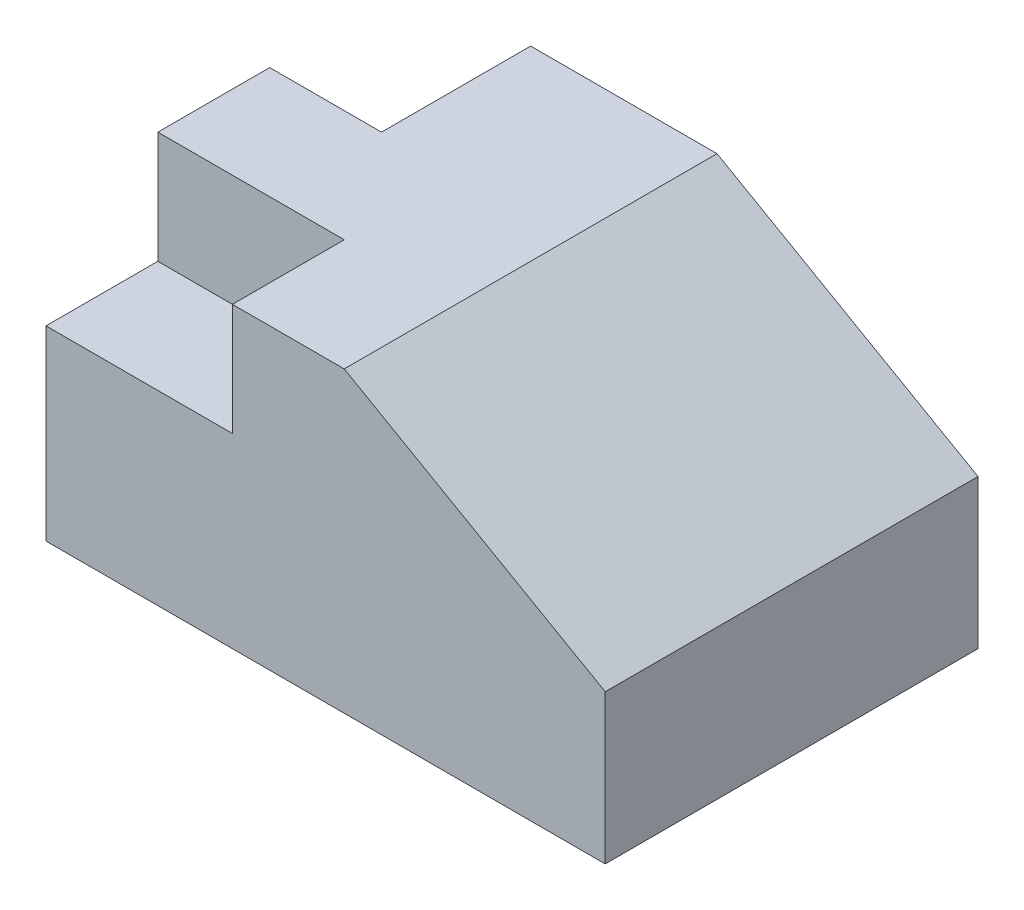
ISO-10303-21;
HEADER;
FILE_DESCRIPTION(('STEP AP214'),'2;1');
FILE_NAME('part.step','',(''),(''),'','','');
FILE_SCHEMA(('AUTOMOTIVE_DESIGN { 1 0 10303 214 1 1 1 1 }'));
ENDSEC;
DATA;
#1=APPLICATION_CONTEXT('core data for automotive mechanical design processes');
#2=APPLICATION_PROTOCOL_DEFINITION('international standard','automotive_design',2000,#1);
#3=PRODUCT_CONTEXT('',#1,'mechanical');
#4=PRODUCT('Part','Part','',(#3));
#5=PRODUCT_RELATED_PRODUCT_CATEGORY('part','',(#4));
#6=PRODUCT_DEFINITION_FORMATION('','',#4);
#7=PRODUCT_DEFINITION_CONTEXT('part definition',#1,'design');
#8=PRODUCT_DEFINITION('design','',#6,#7);
#9=PRODUCT_DEFINITION_SHAPE('','',#8);
#10=(LENGTH_UNIT() NAMED_UNIT(*) SI_UNIT(.MILLI.,.METRE.));
#11=(NAMED_UNIT(*) PLANE_ANGLE_UNIT() SI_UNIT($,.RADIAN.));
#12=(NAMED_UNIT(*) SI_UNIT($,.STERADIAN.) SOLID_ANGLE_UNIT());
#13=UNCERTAINTY_MEASURE_WITH_UNIT(LENGTH_MEASURE(1.E-05),#10,'distance_accuracy_value','');
#14=(GEOMETRIC_REPRESENTATION_CONTEXT(3) GLOBAL_UNCERTAINTY_ASSIGNED_CONTEXT((#13)) GLOBAL_UNIT_ASSIGNED_CONTEXT((#10,
#11,#12)) REPRESENTATION_CONTEXT('',''));
#15=CARTESIAN_POINT('',(0.,0.,0.));
#16=DIRECTION('',(0.,0.,1.));
#17=DIRECTION('',(1.,0.,0.));
#18=AXIS2_PLACEMENT_3D('',#15,#16,#17);
#19=CARTESIAN_POINT('',(-53.5433070866142,32.5459317585302,-100.));
#20=DIRECTION('',(-1.,0.,0.));
#21=DIRECTION('',(0.,-1.,0.));
#22=AXIS2_PLACEMENT_3D('',#19,#20,#21);
#23=PLANE('',#22);
#24=DIRECTION('',(0.,1.,0.));
#25=VECTOR('',#24,1.);
#26=CARTESIAN_POINT('',(-53.5433070866142,-47.4540682414698,-60.));
#27=LINE('',#26,#25);
#28=CARTESIAN_POINT('',(-53.5433070866142,-47.4540682414698,-60.));
#29=VERTEX_POINT('',#28);
#30=CARTESIAN_POINT('',(-53.5433070866142,32.5459317585302,-60.));
#31=VERTEX_POINT('',#30);
#32=EDGE_CURVE('E133',#29,#31,#27,.T.);
#33=ORIENTED_EDGE('',*,*,#32,.F.);
#34=DIRECTION('',(0.,0.,1.));
#35=VECTOR('',#34,1.);
#36=CARTESIAN_POINT('',(-53.5433070866142,-47.4540682414698,-100.));
#37=LINE('',#36,#35);
#38=CARTESIAN_POINT('',(-53.5433070866142,-47.4540682414698,0.));
#39=VERTEX_POINT('',#38);
#40=EDGE_CURVE('E48',#29,#39,#37,.T.);
#41=ORIENTED_EDGE('',*,*,#40,.T.);
#42=DIRECTION('',(0.,-1.,0.));
#43=VECTOR('',#42,1.);
#44=CARTESIAN_POINT('',(-53.5433070866142,32.5459317585302,0.));
#45=LINE('',#44,#43);
#46=CARTESIAN_POINT('',(-53.5433070866142,2.54593175853019,0.));
#47=VERTEX_POINT('',#46);
#48=EDGE_CURVE('E169',#47,#39,#45,.T.);
#49=ORIENTED_EDGE('',*,*,#48,.F.);
#50=DIRECTION('',(0.,0.,1.));
#51=VECTOR('',#50,1.);
#52=CARTESIAN_POINT('',(-53.5433070866142,2.54593175853019,-30.));
#53=LINE('',#52,#51);
#54=CARTESIAN_POINT('',(-53.5433070866142,2.54593175853019,-30.));
#55=VERTEX_POINT('',#54);
#56=EDGE_CURVE('E70',#55,#47,#53,.T.);
#57=ORIENTED_EDGE('',*,*,#56,.F.);
#58=DIRECTION('',(0.,-1.,0.));
#59=VECTOR('',#58,1.);
#60=CARTESIAN_POINT('',(-53.5433070866142,2.54593175853019,-30.));
#61=LINE('',#60,#59);
#62=CARTESIAN_POINT('',(-53.5433070866142,32.5459317585302,-30.));
#63=VERTEX_POINT('',#62);
#64=EDGE_CURVE('E225',#63,#55,#61,.T.);
#65=ORIENTED_EDGE('',*,*,#64,.F.);
#66=DIRECTION('',(0.,0.,1.));
#67=VECTOR('',#66,1.);
#68=CARTESIAN_POINT('',(-53.5433070866142,32.5459317585302,-100.));
#69=LINE('',#68,#67);
#70=EDGE_CURVE('E11',#31,#63,#69,.T.);
#71=ORIENTED_EDGE('',*,*,#70,.F.);
#72=EDGE_LOOP('',(#33,#41,#49,#57,#65,#71));
#73=FACE_BOUND('',#72,.T.);
#74=ADVANCED_FACE('F45',(#73),#23,.T.);
#75=CARTESIAN_POINT('',(26.4566929133858,32.5459317585302,-100.));
#76=DIRECTION('',(0.,1.,0.));
#77=DIRECTION('',(-1.,0.,0.));
#78=AXIS2_PLACEMENT_3D('',#75,#76,#77);
#79=PLANE('',#78);
#80=DIRECTION('',(0.,0.,-1.));
#81=VECTOR('',#80,1.);
#82=CARTESIAN_POINT('',(-23.5433070866142,32.5459317585302,-60.));
#83=LINE('',#82,#81);
#84=CARTESIAN_POINT('',(-23.5433070866142,32.5459317585302,-60.));
#85=VERTEX_POINT('',#84);
#86=CARTESIAN_POINT('',(-23.5433070866142,32.5459317585302,-100.));
#87=VERTEX_POINT('',#86);
#88=EDGE_CURVE('E62',#85,#87,#83,.T.);
#89=ORIENTED_EDGE('',*,*,#88,.F.);
#90=DIRECTION('',(1.,0.,0.));
#91=VECTOR('',#90,1.);
#92=CARTESIAN_POINT('',(-23.5433070866142,32.5459317585302,-60.));
#93=LINE('',#92,#91);
#94=EDGE_CURVE('E142',#31,#85,#93,.T.);
#95=ORIENTED_EDGE('',*,*,#94,.F.);
#96=ORIENTED_EDGE('',*,*,#70,.T.);
#97=DIRECTION('',(-1.,0.,0.));
#98=VECTOR('',#97,1.);
#99=CARTESIAN_POINT('',(-3.54330708661418,32.5459317585302,-30.));
#100=LINE('',#99,#98);
#101=CARTESIAN_POINT('',(-3.54330708661418,32.5459317585302,-30.));
#102=VERTEX_POINT('',#101);
#103=EDGE_CURVE('E209',#102,#63,#100,.T.);
#104=ORIENTED_EDGE('',*,*,#103,.F.);
#105=DIRECTION('',(0.,0.,1.));
#106=VECTOR('',#105,1.);
#107=CARTESIAN_POINT('',(-3.54330708661418,32.5459317585302,-30.));
#108=LINE('',#107,#106);
#109=CARTESIAN_POINT('',(-3.54330708661418,32.5459317585302,0.));
#110=VERTEX_POINT('',#109);
#111=EDGE_CURVE('E160',#102,#110,#108,.T.);
#112=ORIENTED_EDGE('',*,*,#111,.T.);
#113=DIRECTION('',(-1.,0.,0.));
#114=VECTOR('',#113,1.);
#115=CARTESIAN_POINT('',(26.4566929133858,32.5459317585302,0.));
#116=LINE('',#115,#114);
#117=CARTESIAN_POINT('',(26.4566929133858,32.5459317585302,0.));
#118=VERTEX_POINT('',#117);
#119=EDGE_CURVE('E150',#118,#110,#116,.T.);
#120=ORIENTED_EDGE('',*,*,#119,.F.);
#121=DIRECTION('',(0.,0.,1.));
#122=VECTOR('',#121,1.);
#123=CARTESIAN_POINT('',(26.4566929133858,32.5459317585302,-100.));
#124=LINE('',#123,#122);
#125=CARTESIAN_POINT('',(26.4566929133858,32.5459317585302,-100.));
#126=VERTEX_POINT('',#125);
#127=EDGE_CURVE('E54',#126,#118,#124,.T.);
#128=ORIENTED_EDGE('',*,*,#127,.F.);
#129=DIRECTION('',(-1.,0.,0.));
#130=VECTOR('',#129,1.);
#131=CARTESIAN_POINT('',(26.4566929133858,32.5459317585302,-100.));
#132=LINE('',#131,#130);
#133=EDGE_CURVE('E166',#126,#87,#132,.T.);
#134=ORIENTED_EDGE('',*,*,#133,.T.);
#135=EDGE_LOOP('',(#89,#95,#96,#104,#112,#120,#128,#134));
#136=FACE_BOUND('',#135,.T.);
#137=ADVANCED_FACE('F246',(#136),#79,.T.);
#138=CARTESIAN_POINT('',(96.4566929133858,-7.45406824146981,-100.));
#139=DIRECTION('',(0.496138938356834,0.868243142124459,0.));
#140=DIRECTION('',(-0.868243142124459,0.496138938356834,0.));
#141=AXIS2_PLACEMENT_3D('',#138,#139,#140);
#142=PLANE('',#141);
#143=DIRECTION('',(-0.868243142124459,0.496138938356834,0.));
#144=VECTOR('',#143,1.);
#145=CARTESIAN_POINT('',(96.4566929133858,-7.45406824146981,0.));
#146=LINE('',#145,#144);
#147=CARTESIAN_POINT('',(96.4566929133858,-7.45406824146981,0.));
#148=VERTEX_POINT('',#147);
#149=EDGE_CURVE('E157',#148,#118,#146,.T.);
#150=ORIENTED_EDGE('',*,*,#149,.F.);
#151=DIRECTION('',(0.,0.,1.));
#152=VECTOR('',#151,1.);
#153=CARTESIAN_POINT('',(96.4566929133858,-7.45406824146981,-100.));
#154=LINE('',#153,#152);
#155=CARTESIAN_POINT('',(96.4566929133858,-7.45406824146981,-100.));
#156=VERTEX_POINT('',#155);
#157=EDGE_CURVE('E187',#156,#148,#154,.T.);
#158=ORIENTED_EDGE('',*,*,#157,.F.);
#159=DIRECTION('',(-0.868243142124459,0.496138938356834,0.));
#160=VECTOR('',#159,1.);
#161=CARTESIAN_POINT('',(96.4566929133858,-7.45406824146981,-100.));
#162=LINE('',#161,#160);
#163=EDGE_CURVE('E154',#156,#126,#162,.T.);
#164=ORIENTED_EDGE('',*,*,#163,.T.);
#165=ORIENTED_EDGE('',*,*,#127,.T.);
#166=EDGE_LOOP('',(#150,#158,#164,#165));
#167=FACE_BOUND('',#166,.T.);
#168=ADVANCED_FACE('F251',(#167),#142,.T.);
#169=CARTESIAN_POINT('',(96.4566929133858,-47.4540682414698,-100.));
#170=DIRECTION('',(1.,0.,0.));
#171=DIRECTION('',(0.,0.,-1.));
#172=AXIS2_PLACEMENT_3D('',#169,#170,#171);
#173=PLANE('',#172);
#174=DIRECTION('',(0.,1.,0.));
#175=VECTOR('',#174,1.);
#176=CARTESIAN_POINT('',(96.4566929133858,-47.4540682414698,0.));
#177=LINE('',#176,#175);
#178=CARTESIAN_POINT('',(96.4566929133858,-47.4540682414698,0.));
#179=VERTEX_POINT('',#178);
#180=EDGE_CURVE('E178',#179,#148,#177,.T.);
#181=ORIENTED_EDGE('',*,*,#180,.F.);
#182=DIRECTION('',(0.,0.,1.));
#183=VECTOR('',#182,1.);
#184=CARTESIAN_POINT('',(96.4566929133858,-47.4540682414698,-100.));
#185=LINE('',#184,#183);
#186=CARTESIAN_POINT('',(96.4566929133858,-47.4540682414698,-100.));
#187=VERTEX_POINT('',#186);
#188=EDGE_CURVE('E189',#187,#179,#185,.T.);
#189=ORIENTED_EDGE('',*,*,#188,.F.);
#190=DIRECTION('',(0.,1.,0.));
#191=VECTOR('',#190,1.);
#192=CARTESIAN_POINT('',(96.4566929133858,-47.4540682414698,-100.));
#193=LINE('',#192,#191);
#194=EDGE_CURVE('E148',#187,#156,#193,.T.);
#195=ORIENTED_EDGE('',*,*,#194,.T.);
#196=ORIENTED_EDGE('',*,*,#157,.T.);
#197=EDGE_LOOP('',(#181,#189,#195,#196));
#198=FACE_BOUND('',#197,.T.);
#199=ADVANCED_FACE('F249',(#198),#173,.T.);
#200=CARTESIAN_POINT('',(-53.5433070866142,-47.4540682414698,-100.));
#201=DIRECTION('',(0.,-1.,0.));
#202=DIRECTION('',(0.,0.,-1.));
#203=AXIS2_PLACEMENT_3D('',#200,#201,#202);
#204=PLANE('',#203);
#205=DIRECTION('',(0.,0.,-1.));
#206=VECTOR('',#205,1.);
#207=CARTESIAN_POINT('',(-23.5433070866142,-47.4540682414698,-60.));
#208=LINE('',#207,#206);
#209=CARTESIAN_POINT('',(-23.5433070866142,-47.4540682414698,-60.));
#210=VERTEX_POINT('',#209);
#211=CARTESIAN_POINT('',(-23.5433070866142,-47.4540682414698,-100.));
#212=VERTEX_POINT('',#211);
#213=EDGE_CURVE('E126',#210,#212,#208,.T.);
#214=ORIENTED_EDGE('',*,*,#213,.T.);
#215=DIRECTION('',(1.,0.,0.));
#216=VECTOR('',#215,1.);
#217=CARTESIAN_POINT('',(-53.5433070866142,-47.4540682414698,-100.));
#218=LINE('',#217,#216);
#219=EDGE_CURVE('E138',#212,#187,#218,.T.);
#220=ORIENTED_EDGE('',*,*,#219,.T.);
#221=ORIENTED_EDGE('',*,*,#188,.T.);
#222=DIRECTION('',(1.,0.,0.));
#223=VECTOR('',#222,1.);
#224=CARTESIAN_POINT('',(-53.5433070866142,-47.4540682414698,0.));
#225=LINE('',#224,#223);
#226=EDGE_CURVE('E173',#39,#179,#225,.T.);
#227=ORIENTED_EDGE('',*,*,#226,.F.);
#228=ORIENTED_EDGE('',*,*,#40,.F.);
#229=DIRECTION('',(1.,0.,0.));
#230=VECTOR('',#229,1.);
#231=CARTESIAN_POINT('',(-23.5433070866142,-47.4540682414698,-60.));
#232=LINE('',#231,#230);
#233=EDGE_CURVE('E134',#29,#210,#232,.T.);
#234=ORIENTED_EDGE('',*,*,#233,.T.);
#235=EDGE_LOOP('',(#214,#220,#221,#227,#228,#234));
#236=FACE_BOUND('',#235,.T.);
#237=ADVANCED_FACE('F137',(#236),#204,.T.);
#238=CARTESIAN_POINT('',(0.,0.,-100.));
#239=DIRECTION('',(0.,0.,1.));
#240=DIRECTION('',(1.,0.,0.));
#241=AXIS2_PLACEMENT_3D('',#238,#239,#240);
#242=PLANE('',#241);
#243=ORIENTED_EDGE('',*,*,#219,.F.);
#244=DIRECTION('',(0.,1.,0.));
#245=VECTOR('',#244,1.);
#246=CARTESIAN_POINT('',(-23.5433070866142,-47.4540682414698,-100.));
#247=LINE('',#246,#245);
#248=EDGE_CURVE('E123',#212,#87,#247,.T.);
#249=ORIENTED_EDGE('',*,*,#248,.T.);
#250=ORIENTED_EDGE('',*,*,#133,.F.);
#251=ORIENTED_EDGE('',*,*,#163,.F.);
#252=ORIENTED_EDGE('',*,*,#194,.F.);
#253=EDGE_LOOP('',(#243,#249,#250,#251,#252));
#254=FACE_BOUND('',#253,.T.);
#255=ADVANCED_FACE('F145',(#254),#242,.F.);
#256=CARTESIAN_POINT('',(0.,0.,0.));
#257=DIRECTION('',(0.,0.,1.));
#258=DIRECTION('',(1.,0.,0.));
#259=AXIS2_PLACEMENT_3D('',#256,#257,#258);
#260=PLANE('',#259);
#261=DIRECTION('',(0.,1.,0.));
#262=VECTOR('',#261,1.);
#263=CARTESIAN_POINT('',(-3.54330708661418,2.5459317585302,0.));
#264=LINE('',#263,#262);
#265=CARTESIAN_POINT('',(-3.54330708661418,2.5459317585302,0.));
#266=VERTEX_POINT('',#265);
#267=EDGE_CURVE('E202',#266,#110,#264,.T.);
#268=ORIENTED_EDGE('',*,*,#267,.F.);
#269=DIRECTION('',(1.,0.,0.));
#270=VECTOR('',#269,1.);
#271=CARTESIAN_POINT('',(-3.54330708661418,2.5459317585302,0.));
#272=LINE('',#271,#270);
#273=EDGE_CURVE('E201',#47,#266,#272,.T.);
#274=ORIENTED_EDGE('',*,*,#273,.F.);
#275=ORIENTED_EDGE('',*,*,#48,.T.);
#276=ORIENTED_EDGE('',*,*,#226,.T.);
#277=ORIENTED_EDGE('',*,*,#180,.T.);
#278=ORIENTED_EDGE('',*,*,#149,.T.);
#279=ORIENTED_EDGE('',*,*,#119,.T.);
#280=EDGE_LOOP('',(#268,#274,#275,#276,#277,#278,#279));
#281=FACE_BOUND('',#280,.T.);
#282=ADVANCED_FACE('F200',(#281),#260,.T.);
#283=CARTESIAN_POINT('',(-3.54330708661418,2.5459317585302,-30.));
#284=DIRECTION('',(1.,0.,0.));
#285=DIRECTION('',(0.,0.,-1.));
#286=AXIS2_PLACEMENT_3D('',#283,#284,#285);
#287=PLANE('',#286);
#288=ORIENTED_EDGE('',*,*,#267,.T.);
#289=ORIENTED_EDGE('',*,*,#111,.F.);
#290=DIRECTION('',(0.,1.,0.));
#291=VECTOR('',#290,1.);
#292=CARTESIAN_POINT('',(-3.54330708661418,2.5459317585302,-30.));
#293=LINE('',#292,#291);
#294=CARTESIAN_POINT('',(-3.54330708661418,2.5459317585302,-30.));
#295=VERTEX_POINT('',#294);
#296=EDGE_CURVE('E204',#295,#102,#293,.T.);
#297=ORIENTED_EDGE('',*,*,#296,.F.);
#298=DIRECTION('',(0.,0.,1.));
#299=VECTOR('',#298,1.);
#300=CARTESIAN_POINT('',(-3.54330708661418,2.5459317585302,-30.));
#301=LINE('',#300,#299);
#302=EDGE_CURVE('E174',#295,#266,#301,.T.);
#303=ORIENTED_EDGE('',*,*,#302,.T.);
#304=EDGE_LOOP('',(#288,#289,#297,#303));
#305=FACE_BOUND('',#304,.T.);
#306=ADVANCED_FACE('F317',(#305),#287,.F.);
#307=CARTESIAN_POINT('',(-3.54330708661418,2.5459317585302,-30.));
#308=DIRECTION('',(0.,-1.,0.));
#309=DIRECTION('',(1.,0.,0.));
#310=AXIS2_PLACEMENT_3D('',#307,#308,#309);
#311=PLANE('',#310);
#312=ORIENTED_EDGE('',*,*,#273,.T.);
#313=ORIENTED_EDGE('',*,*,#302,.F.);
#314=DIRECTION('',(1.,0.,0.));
#315=VECTOR('',#314,1.);
#316=CARTESIAN_POINT('',(-3.54330708661418,2.5459317585302,-30.));
#317=LINE('',#316,#315);
#318=EDGE_CURVE('E219',#55,#295,#317,.T.);
#319=ORIENTED_EDGE('',*,*,#318,.F.);
#320=ORIENTED_EDGE('',*,*,#56,.T.);
#321=EDGE_LOOP('',(#312,#313,#319,#320));
#322=FACE_BOUND('',#321,.T.);
#323=ADVANCED_FACE('F310',(#322),#311,.F.);
#324=CARTESIAN_POINT('',(0.,0.,-30.));
#325=DIRECTION('',(0.,0.,1.));
#326=DIRECTION('',(1.,0.,0.));
#327=AXIS2_PLACEMENT_3D('',#324,#325,#326);
#328=PLANE('',#327);
#329=ORIENTED_EDGE('',*,*,#296,.T.);
#330=ORIENTED_EDGE('',*,*,#103,.T.);
#331=ORIENTED_EDGE('',*,*,#64,.T.);
#332=ORIENTED_EDGE('',*,*,#318,.T.);
#333=EDGE_LOOP('',(#329,#330,#331,#332));
#334=FACE_BOUND('',#333,.T.);
#335=ADVANCED_FACE('F268',(#334),#328,.T.);
#336=CARTESIAN_POINT('',(-23.5433070866142,-47.4540682414698,-60.));
#337=DIRECTION('',(1.,0.,0.));
#338=DIRECTION('',(0.,1.,0.));
#339=AXIS2_PLACEMENT_3D('',#336,#337,#338);
#340=PLANE('',#339);
#341=ORIENTED_EDGE('',*,*,#88,.T.);
#342=ORIENTED_EDGE('',*,*,#248,.F.);
#343=ORIENTED_EDGE('',*,*,#213,.F.);
#344=DIRECTION('',(0.,1.,0.));
#345=VECTOR('',#344,1.);
#346=CARTESIAN_POINT('',(-23.5433070866142,-47.4540682414698,-60.));
#347=LINE('',#346,#345);
#348=EDGE_CURVE('E211',#210,#85,#347,.T.);
#349=ORIENTED_EDGE('',*,*,#348,.T.);
#350=EDGE_LOOP('',(#341,#342,#343,#349));
#351=FACE_BOUND('',#350,.T.);
#352=ADVANCED_FACE('F125',(#351),#340,.F.);
#353=CARTESIAN_POINT('',(-23.5433070866142,-47.4540682414698,-60.));
#354=DIRECTION('',(0.,0.,1.));
#355=DIRECTION('',(1.,0.,0.));
#356=AXIS2_PLACEMENT_3D('',#353,#354,#355);
#357=PLANE('',#356);
#358=ORIENTED_EDGE('',*,*,#94,.T.);
#359=ORIENTED_EDGE('',*,*,#348,.F.);
#360=ORIENTED_EDGE('',*,*,#233,.F.);
#361=ORIENTED_EDGE('',*,*,#32,.T.);
#362=EDGE_LOOP('',(#358,#359,#360,#361));
#363=FACE_BOUND('',#362,.T.);
#364=ADVANCED_FACE('F245',(#363),#357,.F.);
#365=CLOSED_SHELL('',(#74,#137,#168,#199,#237,#255,#282,#306,#323,#335,#352,#364));
#366=MANIFOLD_SOLID_BREP('B2',#365);
#367=ADVANCED_BREP_SHAPE_REPRESENTATION('',(#18,#366),#14);
#368=SHAPE_DEFINITION_REPRESENTATION(#9,#367);
ENDSEC;
END-ISO-10303-21;
